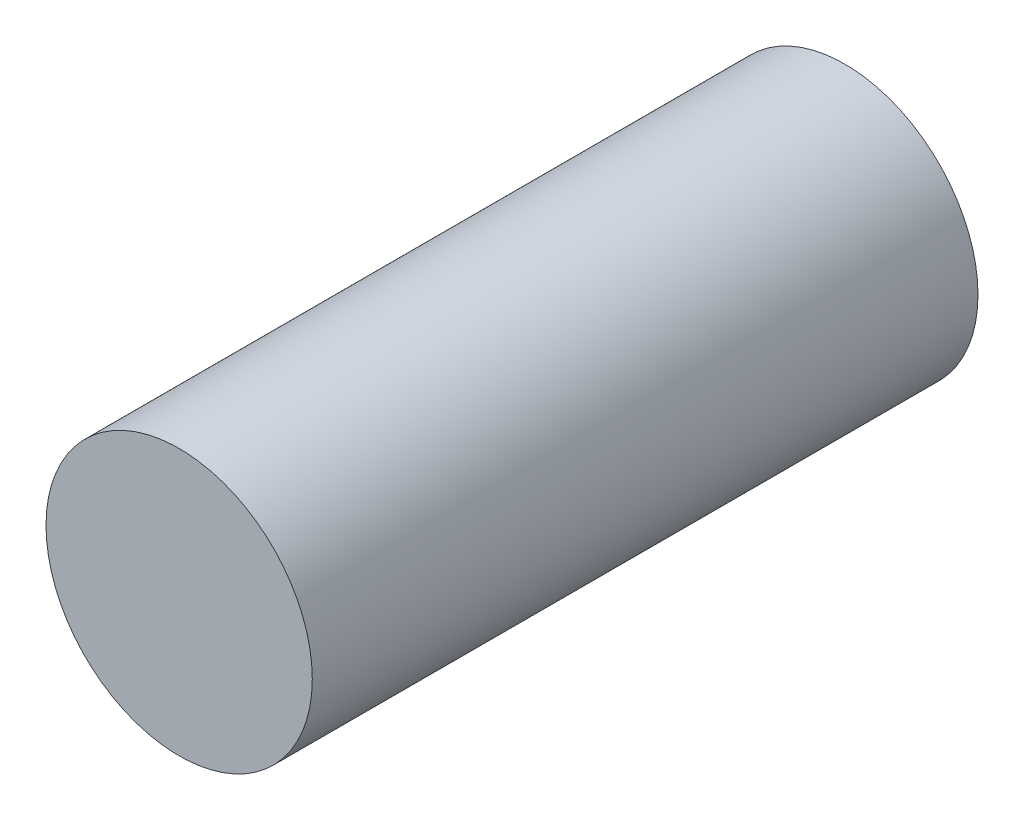
ISO-10303-21;
HEADER;
FILE_DESCRIPTION(('STEP AP214'),'2;1');
FILE_NAME('part.step','',(''),(''),'','','');
FILE_SCHEMA(('AUTOMOTIVE_DESIGN { 1 0 10303 214 1 1 1 1 }'));
ENDSEC;
DATA;
#1=APPLICATION_CONTEXT('core data for automotive mechanical design processes');
#2=APPLICATION_PROTOCOL_DEFINITION('international standard','automotive_design',2000,#1);
#3=PRODUCT_CONTEXT('',#1,'mechanical');
#4=PRODUCT('Part','Part','',(#3));
#5=PRODUCT_RELATED_PRODUCT_CATEGORY('part','',(#4));
#6=PRODUCT_DEFINITION_FORMATION('','',#4);
#7=PRODUCT_DEFINITION_CONTEXT('part definition',#1,'design');
#8=PRODUCT_DEFINITION('design','',#6,#7);
#9=PRODUCT_DEFINITION_SHAPE('','',#8);
#10=(LENGTH_UNIT() NAMED_UNIT(*) SI_UNIT(.MILLI.,.METRE.));
#11=(NAMED_UNIT(*) PLANE_ANGLE_UNIT() SI_UNIT($,.RADIAN.));
#12=(NAMED_UNIT(*) SI_UNIT($,.STERADIAN.) SOLID_ANGLE_UNIT());
#13=UNCERTAINTY_MEASURE_WITH_UNIT(LENGTH_MEASURE(1.E-05),#10,'distance_accuracy_value','');
#14=(GEOMETRIC_REPRESENTATION_CONTEXT(3) GLOBAL_UNCERTAINTY_ASSIGNED_CONTEXT((#13)) GLOBAL_UNIT_ASSIGNED_CONTEXT((#10,
#11,#12)) REPRESENTATION_CONTEXT('',''));
#15=CARTESIAN_POINT('',(0.,0.,0.));
#16=DIRECTION('',(0.,0.,1.));
#17=DIRECTION('',(1.,0.,0.));
#18=AXIS2_PLACEMENT_3D('',#15,#16,#17);
#19=CARTESIAN_POINT('',(-5.39999999999999,0.,-2.5));
#20=DIRECTION('',(0.,0.,-1.));
#21=DIRECTION('',(-1.,0.,0.));
#22=AXIS2_PLACEMENT_3D('',#19,#20,#21);
#23=PLANE('',#22);
#24=CARTESIAN_POINT('',(-5.4,0.,-2.5));
#25=DIRECTION('',(0.,0.,-1.));
#26=DIRECTION('',(-1.,0.,0.));
#27=AXIS2_PLACEMENT_3D('',#24,#25,#26);
#28=CIRCLE('',#27,0.599999999999999);
#29=CARTESIAN_POINT('',(-6.,0.,-2.5));
#30=VERTEX_POINT('',#29);
#31=EDGE_CURVE('E17',#30,#30,#28,.F.);
#32=ORIENTED_EDGE('',*,*,#31,.F.);
#33=EDGE_LOOP('',(#32));
#34=FACE_BOUND('',#33,.T.);
#35=ADVANCED_FACE('F14',(#34),#23,.T.);
#36=CARTESIAN_POINT('',(-5.4,0.,0.499999999999999));
#37=DIRECTION('',(0.,0.,-1.));
#38=DIRECTION('',(-1.,0.,0.));
#39=AXIS2_PLACEMENT_3D('',#36,#37,#38);
#40=PLANE('',#39);
#41=CARTESIAN_POINT('',(-5.4,0.,0.499999999999999));
#42=DIRECTION('',(0.,0.,-1.));
#43=DIRECTION('',(-1.,0.,0.));
#44=AXIS2_PLACEMENT_3D('',#41,#42,#43);
#45=CIRCLE('',#44,0.599999999999999);
#46=CARTESIAN_POINT('',(-6.,0.,0.499999999999999));
#47=VERTEX_POINT('',#46);
#48=EDGE_CURVE('E10',#47,#47,#45,.T.);
#49=ORIENTED_EDGE('',*,*,#48,.F.);
#50=EDGE_LOOP('',(#49));
#51=FACE_BOUND('',#50,.T.);
#52=ADVANCED_FACE('F29',(#51),#40,.F.);
#53=CARTESIAN_POINT('',(-5.4,0.,0.499999999999999));
#54=DIRECTION('',(0.,0.,-1.));
#55=DIRECTION('',(-1.,0.,0.));
#56=AXIS2_PLACEMENT_3D('',#53,#54,#55);
#57=CYLINDRICAL_SURFACE('',#56,0.599999999999999);
#58=ORIENTED_EDGE('',*,*,#48,.T.);
#59=EDGE_LOOP('',(#58));
#60=FACE_BOUND('',#59,.T.);
#61=ORIENTED_EDGE('',*,*,#31,.T.);
#62=EDGE_LOOP('',(#61));
#63=FACE_BOUND('',#62,.T.);
#64=ADVANCED_FACE('F26',(#60,#63),#57,.T.);
#65=CLOSED_SHELL('',(#35,#52,#64));
#66=MANIFOLD_SOLID_BREP('B1',#65);
#67=ADVANCED_BREP_SHAPE_REPRESENTATION('',(#18,#66),#14);
#68=SHAPE_DEFINITION_REPRESENTATION(#9,#67);
ENDSEC;
END-ISO-10303-21;
